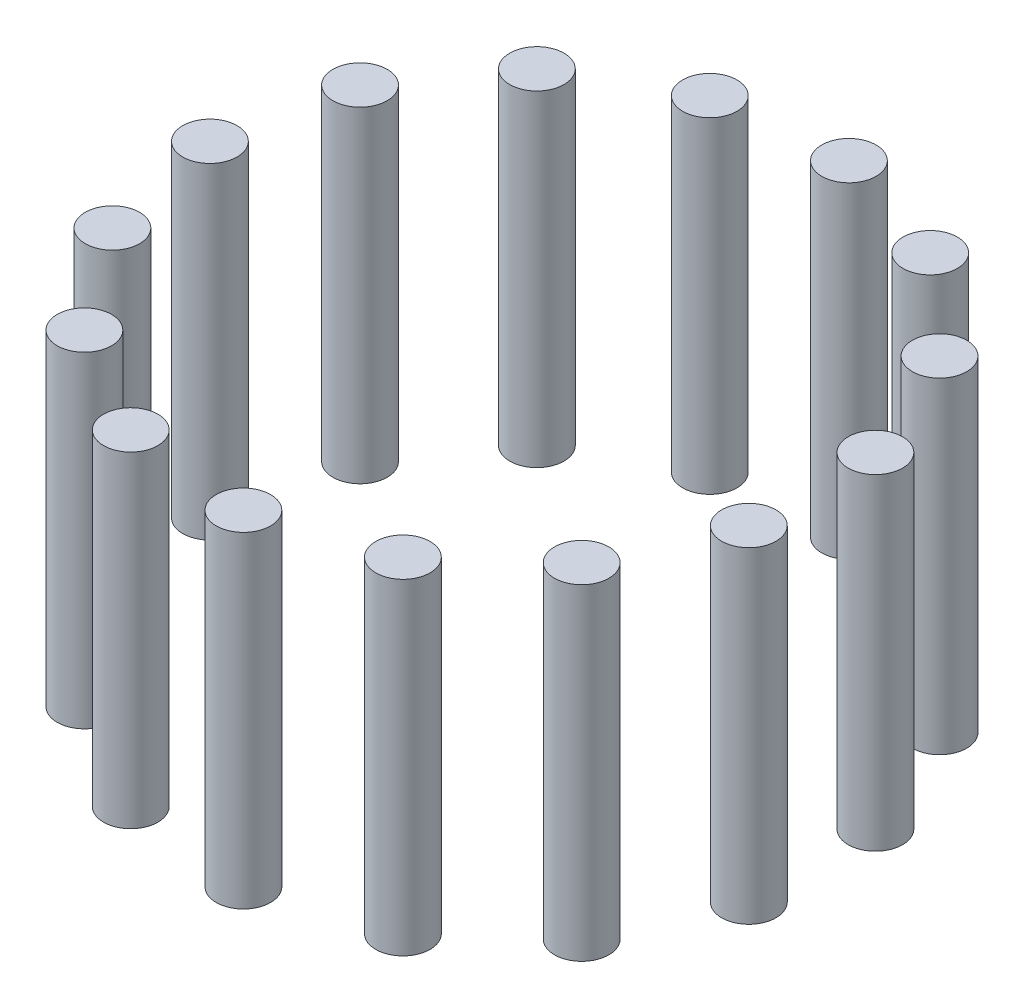
ISO-10303-21;
HEADER;
FILE_DESCRIPTION(('STEP AP214'),'2;1');
FILE_NAME('part.step','',(''),(''),'','','');
FILE_SCHEMA(('AUTOMOTIVE_DESIGN { 1 0 10303 214 1 1 1 1 }'));
ENDSEC;
DATA;
#1=APPLICATION_CONTEXT('core data for automotive mechanical design processes');
#2=APPLICATION_PROTOCOL_DEFINITION('international standard','automotive_design',2000,#1);
#3=PRODUCT_CONTEXT('',#1,'mechanical');
#4=PRODUCT('Part','Part','',(#3));
#5=PRODUCT_RELATED_PRODUCT_CATEGORY('part','',(#4));
#6=PRODUCT_DEFINITION_FORMATION('','',#4);
#7=PRODUCT_DEFINITION_CONTEXT('part definition',#1,'design');
#8=PRODUCT_DEFINITION('design','',#6,#7);
#9=PRODUCT_DEFINITION_SHAPE('','',#8);
#10=(LENGTH_UNIT() NAMED_UNIT(*) SI_UNIT(.MILLI.,.METRE.));
#11=(NAMED_UNIT(*) PLANE_ANGLE_UNIT() SI_UNIT($,.RADIAN.));
#12=(NAMED_UNIT(*) SI_UNIT($,.STERADIAN.) SOLID_ANGLE_UNIT());
#13=UNCERTAINTY_MEASURE_WITH_UNIT(LENGTH_MEASURE(1.E-05),#10,'distance_accuracy_value','');
#14=(GEOMETRIC_REPRESENTATION_CONTEXT(3) GLOBAL_UNCERTAINTY_ASSIGNED_CONTEXT((#13)) GLOBAL_UNIT_ASSIGNED_CONTEXT((#10,
#11,#12)) REPRESENTATION_CONTEXT('',''));
#15=CARTESIAN_POINT('',(0.,0.,0.));
#16=DIRECTION('',(0.,0.,1.));
#17=DIRECTION('',(1.,0.,0.));
#18=AXIS2_PLACEMENT_3D('',#15,#16,#17);
#19=CARTESIAN_POINT('',(22.6524758424982,30.,-16.4579870641889));
#20=DIRECTION('',(0.,-1.,0.));
#21=DIRECTION('',(0.,0.,-1.));
#22=AXIS2_PLACEMENT_3D('',#19,#20,#21);
#23=CYLINDRICAL_SURFACE('',#22,2.50000000000044);
#24=CARTESIAN_POINT('',(22.6524758424982,30.,-16.4579870641889));
#25=DIRECTION('',(0.,1.,0.));
#26=DIRECTION('',(0.,0.,1.));
#27=AXIS2_PLACEMENT_3D('',#24,#25,#26);
#28=CIRCLE('',#27,2.50000000000044);
#29=CARTESIAN_POINT('',(22.6524758424982,30.,-13.9579870641885));
#30=VERTEX_POINT('',#29);
#31=EDGE_CURVE('E11',#30,#30,#28,.T.);
#32=ORIENTED_EDGE('',*,*,#31,.F.);
#33=EDGE_LOOP('',(#32));
#34=FACE_BOUND('',#33,.T.);
#35=CARTESIAN_POINT('',(22.6524758424982,0.,-16.4579870641889));
#36=DIRECTION('',(0.,1.,0.));
#37=DIRECTION('',(0.,0.,1.));
#38=AXIS2_PLACEMENT_3D('',#35,#36,#37);
#39=CIRCLE('',#38,2.50000000000044);
#40=CARTESIAN_POINT('',(22.6524758424982,0.,-13.9579870641885));
#41=VERTEX_POINT('',#40);
#42=EDGE_CURVE('E43',#41,#41,#39,.T.);
#43=ORIENTED_EDGE('',*,*,#42,.T.);
#44=EDGE_LOOP('',(#43));
#45=FACE_BOUND('',#44,.T.);
#46=ADVANCED_FACE('F40',(#34,#45),#23,.T.);
#47=CARTESIAN_POINT('',(22.6524758424982,30.,-16.4579870641889));
#48=DIRECTION('',(0.,1.,0.));
#49=DIRECTION('',(0.,0.,1.));
#50=AXIS2_PLACEMENT_3D('',#47,#48,#49);
#51=PLANE('',#50);
#52=ORIENTED_EDGE('',*,*,#31,.T.);
#53=EDGE_LOOP('',(#52));
#54=FACE_BOUND('',#53,.T.);
#55=ADVANCED_FACE('F55',(#54),#51,.T.);
#56=CARTESIAN_POINT('',(22.6524758424982,0.,-16.4579870641889));
#57=DIRECTION('',(0.,1.,0.));
#58=DIRECTION('',(0.,0.,1.));
#59=AXIS2_PLACEMENT_3D('',#56,#57,#58);
#60=PLANE('',#59);
#61=ORIENTED_EDGE('',*,*,#42,.F.);
#62=EDGE_LOOP('',(#61));
#63=FACE_BOUND('',#62,.T.);
#64=ADVANCED_FACE('F53',(#63),#60,.F.);
#65=CLOSED_SHELL('',(#46,#55,#64));
#66=MANIFOLD_SOLID_BREP('B2',#65);
#67=CARTESIAN_POINT('',(13.9999999999994,30.,-24.2487113059636));
#68=DIRECTION('',(0.,-1.,0.));
#69=DIRECTION('',(0.,0.,-1.));
#70=AXIS2_PLACEMENT_3D('',#67,#68,#69);
#71=CYLINDRICAL_SURFACE('',#70,2.50000000000078);
#72=CARTESIAN_POINT('',(13.9999999999994,30.,-24.2487113059636));
#73=DIRECTION('',(0.,1.,0.));
#74=DIRECTION('',(0.,0.,1.));
#75=AXIS2_PLACEMENT_3D('',#72,#73,#74);
#76=CIRCLE('',#75,2.50000000000078);
#77=CARTESIAN_POINT('',(13.9999999999994,30.,-21.7487113059629));
#78=VERTEX_POINT('',#77);
#79=EDGE_CURVE('E39',#78,#78,#76,.T.);
#80=ORIENTED_EDGE('',*,*,#79,.F.);
#81=EDGE_LOOP('',(#80));
#82=FACE_BOUND('',#81,.T.);
#83=CARTESIAN_POINT('',(13.9999999999994,0.,-24.2487113059636));
#84=DIRECTION('',(0.,1.,0.));
#85=DIRECTION('',(0.,0.,1.));
#86=AXIS2_PLACEMENT_3D('',#83,#84,#85);
#87=CIRCLE('',#86,2.50000000000078);
#88=CARTESIAN_POINT('',(13.9999999999994,0.,-21.7487113059629));
#89=VERTEX_POINT('',#88);
#90=EDGE_CURVE('E92',#89,#89,#87,.T.);
#91=ORIENTED_EDGE('',*,*,#90,.T.);
#92=EDGE_LOOP('',(#91));
#93=FACE_BOUND('',#92,.T.);
#94=ADVANCED_FACE('F89',(#82,#93),#71,.T.);
#95=CARTESIAN_POINT('',(13.9999999999994,30.,-24.2487113059636));
#96=DIRECTION('',(0.,1.,0.));
#97=DIRECTION('',(0.,0.,1.));
#98=AXIS2_PLACEMENT_3D('',#95,#96,#97);
#99=PLANE('',#98);
#100=ORIENTED_EDGE('',*,*,#79,.T.);
#101=EDGE_LOOP('',(#100));
#102=FACE_BOUND('',#101,.T.);
#103=ADVANCED_FACE('F104',(#102),#99,.T.);
#104=CARTESIAN_POINT('',(13.9999999999994,0.,-24.2487113059636));
#105=DIRECTION('',(0.,1.,0.));
#106=DIRECTION('',(0.,0.,1.));
#107=AXIS2_PLACEMENT_3D('',#104,#105,#106);
#108=PLANE('',#107);
#109=ORIENTED_EDGE('',*,*,#90,.F.);
#110=EDGE_LOOP('',(#109));
#111=FACE_BOUND('',#110,.T.);
#112=ADVANCED_FACE('F102',(#111),#108,.F.);
#113=CLOSED_SHELL('',(#94,#103,#112));
#114=MANIFOLD_SOLID_BREP('B6',#113);
#115=CARTESIAN_POINT('',(2.92679697149355,30.,-27.8466130703106));
#116=DIRECTION('',(0.,-1.,0.));
#117=DIRECTION('',(0.,0.,-1.));
#118=AXIS2_PLACEMENT_3D('',#115,#116,#117);
#119=CYLINDRICAL_SURFACE('',#118,2.500000000001);
#120=CARTESIAN_POINT('',(2.92679697149355,30.,-27.8466130703106));
#121=DIRECTION('',(0.,1.,0.));
#122=DIRECTION('',(0.,0.,1.));
#123=AXIS2_PLACEMENT_3D('',#120,#121,#122);
#124=CIRCLE('',#123,2.500000000001);
#125=CARTESIAN_POINT('',(2.92679697149355,30.,-25.3466130703096));
#126=VERTEX_POINT('',#125);
#127=EDGE_CURVE('E88',#126,#126,#124,.T.);
#128=ORIENTED_EDGE('',*,*,#127,.F.);
#129=EDGE_LOOP('',(#128));
#130=FACE_BOUND('',#129,.T.);
#131=CARTESIAN_POINT('',(2.92679697149355,0.,-27.8466130703106));
#132=DIRECTION('',(0.,1.,0.));
#133=DIRECTION('',(0.,0.,1.));
#134=AXIS2_PLACEMENT_3D('',#131,#132,#133);
#135=CIRCLE('',#134,2.500000000001);
#136=CARTESIAN_POINT('',(2.92679697149355,0.,-25.3466130703096));
#137=VERTEX_POINT('',#136);
#138=EDGE_CURVE('E141',#137,#137,#135,.T.);
#139=ORIENTED_EDGE('',*,*,#138,.T.);
#140=EDGE_LOOP('',(#139));
#141=FACE_BOUND('',#140,.T.);
#142=ADVANCED_FACE('F138',(#130,#141),#119,.T.);
#143=CARTESIAN_POINT('',(2.92679697149355,30.,-27.8466130703106));
#144=DIRECTION('',(0.,1.,0.));
#145=DIRECTION('',(0.,0.,1.));
#146=AXIS2_PLACEMENT_3D('',#143,#144,#145);
#147=PLANE('',#146);
#148=ORIENTED_EDGE('',*,*,#127,.T.);
#149=EDGE_LOOP('',(#148));
#150=FACE_BOUND('',#149,.T.);
#151=ADVANCED_FACE('F153',(#150),#147,.T.);
#152=CARTESIAN_POINT('',(2.92679697149355,0.,-27.8466130703106));
#153=DIRECTION('',(0.,1.,0.));
#154=DIRECTION('',(0.,0.,1.));
#155=AXIS2_PLACEMENT_3D('',#152,#153,#154);
#156=PLANE('',#155);
#157=ORIENTED_EDGE('',*,*,#138,.F.);
#158=EDGE_LOOP('',(#157));
#159=FACE_BOUND('',#158,.T.);
#160=ADVANCED_FACE('F151',(#159),#156,.F.);
#161=CLOSED_SHELL('',(#142,#151,#160));
#162=MANIFOLD_SOLID_BREP('B34',#161);
#163=CARTESIAN_POINT('',(-8.65247584249925,30.,-26.6295824562629));
#164=DIRECTION('',(0.,-1.,0.));
#165=DIRECTION('',(0.,0.,-1.));
#166=AXIS2_PLACEMENT_3D('',#163,#164,#165);
#167=CYLINDRICAL_SURFACE('',#166,2.500000000001);
#168=CARTESIAN_POINT('',(-8.65247584249925,30.,-26.6295824562629));
#169=DIRECTION('',(0.,1.,0.));
#170=DIRECTION('',(0.,0.,1.));
#171=AXIS2_PLACEMENT_3D('',#168,#169,#170);
#172=CIRCLE('',#171,2.500000000001);
#173=CARTESIAN_POINT('',(-8.65247584249925,30.,-24.1295824562619));
#174=VERTEX_POINT('',#173);
#175=EDGE_CURVE('E137',#174,#174,#172,.T.);
#176=ORIENTED_EDGE('',*,*,#175,.F.);
#177=EDGE_LOOP('',(#176));
#178=FACE_BOUND('',#177,.T.);
#179=CARTESIAN_POINT('',(-8.65247584249925,0.,-26.6295824562629));
#180=DIRECTION('',(0.,1.,0.));
#181=DIRECTION('',(0.,0.,1.));
#182=AXIS2_PLACEMENT_3D('',#179,#180,#181);
#183=CIRCLE('',#182,2.500000000001);
#184=CARTESIAN_POINT('',(-8.65247584249925,0.,-24.1295824562619));
#185=VERTEX_POINT('',#184);
#186=EDGE_CURVE('E190',#185,#185,#183,.T.);
#187=ORIENTED_EDGE('',*,*,#186,.T.);
#188=EDGE_LOOP('',(#187));
#189=FACE_BOUND('',#188,.T.);
#190=ADVANCED_FACE('F187',(#178,#189),#167,.T.);
#191=CARTESIAN_POINT('',(-8.65247584249925,30.,-26.6295824562629));
#192=DIRECTION('',(0.,1.,0.));
#193=DIRECTION('',(0.,0.,1.));
#194=AXIS2_PLACEMENT_3D('',#191,#192,#193);
#195=PLANE('',#194);
#196=ORIENTED_EDGE('',*,*,#175,.T.);
#197=EDGE_LOOP('',(#196));
#198=FACE_BOUND('',#197,.T.);
#199=ADVANCED_FACE('F202',(#198),#195,.T.);
#200=CARTESIAN_POINT('',(-8.65247584249925,0.,-26.6295824562629));
#201=DIRECTION('',(0.,1.,0.));
#202=DIRECTION('',(0.,0.,1.));
#203=AXIS2_PLACEMENT_3D('',#200,#201,#202);
#204=PLANE('',#203);
#205=ORIENTED_EDGE('',*,*,#186,.F.);
#206=EDGE_LOOP('',(#205));
#207=FACE_BOUND('',#206,.T.);
#208=ADVANCED_FACE('F200',(#207),#204,.F.);
#209=CLOSED_SHELL('',(#190,#199,#208));
#210=MANIFOLD_SOLID_BREP('B83',#209);
#211=CARTESIAN_POINT('',(-18.7356569780485,30.,-20.8080551133652));
#212=DIRECTION('',(0.,-1.,0.));
#213=DIRECTION('',(0.,0.,-1.));
#214=AXIS2_PLACEMENT_3D('',#211,#212,#213);
#215=CYLINDRICAL_SURFACE('',#214,2.50000000000081);
#216=CARTESIAN_POINT('',(-18.7356569780485,30.,-20.8080551133652));
#217=DIRECTION('',(0.,1.,0.));
#218=DIRECTION('',(0.,0.,1.));
#219=AXIS2_PLACEMENT_3D('',#216,#217,#218);
#220=CIRCLE('',#219,2.50000000000081);
#221=CARTESIAN_POINT('',(-18.7356569780485,30.,-18.3080551133644));
#222=VERTEX_POINT('',#221);
#223=EDGE_CURVE('E186',#222,#222,#220,.T.);
#224=ORIENTED_EDGE('',*,*,#223,.F.);
#225=EDGE_LOOP('',(#224));
#226=FACE_BOUND('',#225,.T.);
#227=CARTESIAN_POINT('',(-18.7356569780485,0.,-20.8080551133652));
#228=DIRECTION('',(0.,1.,0.));
#229=DIRECTION('',(0.,0.,1.));
#230=AXIS2_PLACEMENT_3D('',#227,#228,#229);
#231=CIRCLE('',#230,2.50000000000081);
#232=CARTESIAN_POINT('',(-18.7356569780485,0.,-18.3080551133644));
#233=VERTEX_POINT('',#232);
#234=EDGE_CURVE('E239',#233,#233,#231,.T.);
#235=ORIENTED_EDGE('',*,*,#234,.T.);
#236=EDGE_LOOP('',(#235));
#237=FACE_BOUND('',#236,.T.);
#238=ADVANCED_FACE('F236',(#226,#237),#215,.T.);
#239=CARTESIAN_POINT('',(-18.7356569780485,30.,-20.8080551133652));
#240=DIRECTION('',(0.,1.,0.));
#241=DIRECTION('',(0.,0.,1.));
#242=AXIS2_PLACEMENT_3D('',#239,#240,#241);
#243=PLANE('',#242);
#244=ORIENTED_EDGE('',*,*,#223,.T.);
#245=EDGE_LOOP('',(#244));
#246=FACE_BOUND('',#245,.T.);
#247=ADVANCED_FACE('F251',(#246),#243,.T.);
#248=CARTESIAN_POINT('',(-18.7356569780485,0.,-20.8080551133652));
#249=DIRECTION('',(0.,1.,0.));
#250=DIRECTION('',(0.,0.,1.));
#251=AXIS2_PLACEMENT_3D('',#248,#249,#250);
#252=PLANE('',#251);
#253=ORIENTED_EDGE('',*,*,#234,.F.);
#254=EDGE_LOOP('',(#253));
#255=FACE_BOUND('',#254,.T.);
#256=ADVANCED_FACE('F249',(#255),#252,.F.);
#257=CLOSED_SHELL('',(#238,#247,#256));
#258=MANIFOLD_SOLID_BREP('B132',#257);
#259=CARTESIAN_POINT('',(-25.579272813993,30.,-11.3886260061204));
#260=DIRECTION('',(0.,-1.,0.));
#261=DIRECTION('',(0.,0.,-1.));
#262=AXIS2_PLACEMENT_3D('',#259,#260,#261);
#263=CYLINDRICAL_SURFACE('',#262,2.50000000000046);
#264=CARTESIAN_POINT('',(-25.579272813993,30.,-11.3886260061204));
#265=DIRECTION('',(0.,1.,0.));
#266=DIRECTION('',(0.,0.,1.));
#267=AXIS2_PLACEMENT_3D('',#264,#265,#266);
#268=CIRCLE('',#267,2.50000000000046);
#269=CARTESIAN_POINT('',(-25.579272813993,30.,-8.88862600611992));
#270=VERTEX_POINT('',#269);
#271=EDGE_CURVE('E235',#270,#270,#268,.T.);
#272=ORIENTED_EDGE('',*,*,#271,.F.);
#273=EDGE_LOOP('',(#272));
#274=FACE_BOUND('',#273,.T.);
#275=CARTESIAN_POINT('',(-25.579272813993,0.,-11.3886260061204));
#276=DIRECTION('',(0.,1.,0.));
#277=DIRECTION('',(0.,0.,1.));
#278=AXIS2_PLACEMENT_3D('',#275,#276,#277);
#279=CIRCLE('',#278,2.50000000000046);
#280=CARTESIAN_POINT('',(-25.579272813993,0.,-8.88862600611992));
#281=VERTEX_POINT('',#280);
#282=EDGE_CURVE('E288',#281,#281,#279,.T.);
#283=ORIENTED_EDGE('',*,*,#282,.T.);
#284=EDGE_LOOP('',(#283));
#285=FACE_BOUND('',#284,.T.);
#286=ADVANCED_FACE('F285',(#274,#285),#263,.T.);
#287=CARTESIAN_POINT('',(-25.579272813993,30.,-11.3886260061204));
#288=DIRECTION('',(0.,1.,0.));
#289=DIRECTION('',(0.,0.,1.));
#290=AXIS2_PLACEMENT_3D('',#287,#288,#289);
#291=PLANE('',#290);
#292=ORIENTED_EDGE('',*,*,#271,.T.);
#293=EDGE_LOOP('',(#292));
#294=FACE_BOUND('',#293,.T.);
#295=ADVANCED_FACE('F300',(#294),#291,.T.);
#296=CARTESIAN_POINT('',(-25.579272813993,0.,-11.3886260061204));
#297=DIRECTION('',(0.,1.,0.));
#298=DIRECTION('',(0.,0.,1.));
#299=AXIS2_PLACEMENT_3D('',#296,#297,#298);
#300=PLANE('',#299);
#301=ORIENTED_EDGE('',*,*,#282,.F.);
#302=EDGE_LOOP('',(#301));
#303=FACE_BOUND('',#302,.T.);
#304=ADVANCED_FACE('F298',(#303),#300,.F.);
#305=CLOSED_SHELL('',(#286,#295,#304));
#306=MANIFOLD_SOLID_BREP('B181',#305);
#307=CARTESIAN_POINT('',(-27.9999999999998,30.,2.12402832064592E-12));
#308=DIRECTION('',(0.,-1.,0.));
#309=DIRECTION('',(0.,0.,-1.));
#310=AXIS2_PLACEMENT_3D('',#307,#308,#309);
#311=CYLINDRICAL_SURFACE('',#310,2.50000000000001);
#312=CARTESIAN_POINT('',(-27.9999999999998,30.,2.12402832064592E-12));
#313=DIRECTION('',(0.,1.,0.));
#314=DIRECTION('',(0.,0.,1.));
#315=AXIS2_PLACEMENT_3D('',#312,#313,#314);
#316=CIRCLE('',#315,2.50000000000001);
#317=CARTESIAN_POINT('',(-27.9999999999998,30.,2.50000000000214));
#318=VERTEX_POINT('',#317);
#319=EDGE_CURVE('E284',#318,#318,#316,.T.);
#320=ORIENTED_EDGE('',*,*,#319,.F.);
#321=EDGE_LOOP('',(#320));
#322=FACE_BOUND('',#321,.T.);
#323=CARTESIAN_POINT('',(-27.9999999999998,0.,2.12402832064592E-12));
#324=DIRECTION('',(0.,1.,0.));
#325=DIRECTION('',(0.,0.,1.));
#326=AXIS2_PLACEMENT_3D('',#323,#324,#325);
#327=CIRCLE('',#326,2.50000000000001);
#328=CARTESIAN_POINT('',(-27.9999999999998,0.,2.50000000000214));
#329=VERTEX_POINT('',#328);
#330=EDGE_CURVE('E337',#329,#329,#327,.T.);
#331=ORIENTED_EDGE('',*,*,#330,.T.);
#332=EDGE_LOOP('',(#331));
#333=FACE_BOUND('',#332,.T.);
#334=ADVANCED_FACE('F334',(#322,#333),#311,.T.);
#335=CARTESIAN_POINT('',(-27.9999999999998,30.,2.12402832064592E-12));
#336=DIRECTION('',(0.,1.,0.));
#337=DIRECTION('',(0.,0.,1.));
#338=AXIS2_PLACEMENT_3D('',#335,#336,#337);
#339=PLANE('',#338);
#340=ORIENTED_EDGE('',*,*,#319,.T.);
#341=EDGE_LOOP('',(#340));
#342=FACE_BOUND('',#341,.T.);
#343=ADVANCED_FACE('F349',(#342),#339,.T.);
#344=CARTESIAN_POINT('',(-27.9999999999998,0.,2.12402832064592E-12));
#345=DIRECTION('',(0.,1.,0.));
#346=DIRECTION('',(0.,0.,1.));
#347=AXIS2_PLACEMENT_3D('',#344,#345,#346);
#348=PLANE('',#347);
#349=ORIENTED_EDGE('',*,*,#330,.F.);
#350=EDGE_LOOP('',(#349));
#351=FACE_BOUND('',#350,.T.);
#352=ADVANCED_FACE('F347',(#351),#348,.F.);
#353=CLOSED_SHELL('',(#334,#343,#352));
#354=MANIFOLD_SOLID_BREP('B230',#353);
#355=CARTESIAN_POINT('',(-25.5792728139922,30.,11.3886260061244));
#356=DIRECTION('',(0.,-1.,0.));
#357=DIRECTION('',(0.,0.,-1.));
#358=AXIS2_PLACEMENT_3D('',#355,#356,#357);
#359=CYLINDRICAL_SURFACE('',#358,2.49999999999954);
#360=CARTESIAN_POINT('',(-25.5792728139922,30.,11.3886260061244));
#361=DIRECTION('',(0.,1.,0.));
#362=DIRECTION('',(0.,0.,1.));
#363=AXIS2_PLACEMENT_3D('',#360,#361,#362);
#364=CIRCLE('',#363,2.49999999999954);
#365=CARTESIAN_POINT('',(-25.5792728139922,30.,13.888626006124));
#366=VERTEX_POINT('',#365);
#367=EDGE_CURVE('E333',#366,#366,#364,.T.);
#368=ORIENTED_EDGE('',*,*,#367,.F.);
#369=EDGE_LOOP('',(#368));
#370=FACE_BOUND('',#369,.T.);
#371=CARTESIAN_POINT('',(-25.5792728139922,0.,11.3886260061244));
#372=DIRECTION('',(0.,1.,0.));
#373=DIRECTION('',(0.,0.,1.));
#374=AXIS2_PLACEMENT_3D('',#371,#372,#373);
#375=CIRCLE('',#374,2.49999999999954);
#376=CARTESIAN_POINT('',(-25.5792728139922,0.,13.888626006124));
#377=VERTEX_POINT('',#376);
#378=EDGE_CURVE('E386',#377,#377,#375,.T.);
#379=ORIENTED_EDGE('',*,*,#378,.T.);
#380=EDGE_LOOP('',(#379));
#381=FACE_BOUND('',#380,.T.);
#382=ADVANCED_FACE('F383',(#370,#381),#359,.T.);
#383=CARTESIAN_POINT('',(-25.5792728139922,30.,11.3886260061244));
#384=DIRECTION('',(0.,1.,0.));
#385=DIRECTION('',(0.,0.,1.));
#386=AXIS2_PLACEMENT_3D('',#383,#384,#385);
#387=PLANE('',#386);
#388=ORIENTED_EDGE('',*,*,#367,.T.);
#389=EDGE_LOOP('',(#388));
#390=FACE_BOUND('',#389,.T.);
#391=ADVANCED_FACE('F398',(#390),#387,.T.);
#392=CARTESIAN_POINT('',(-25.5792728139922,0.,11.3886260061244));
#393=DIRECTION('',(0.,1.,0.));
#394=DIRECTION('',(0.,0.,1.));
#395=AXIS2_PLACEMENT_3D('',#392,#393,#394);
#396=PLANE('',#395);
#397=ORIENTED_EDGE('',*,*,#378,.F.);
#398=EDGE_LOOP('',(#397));
#399=FACE_BOUND('',#398,.T.);
#400=ADVANCED_FACE('F396',(#399),#396,.F.);
#401=CLOSED_SHELL('',(#382,#391,#400));
#402=MANIFOLD_SOLID_BREP('B279',#401);
#403=CARTESIAN_POINT('',(-18.7356569780471,30.,20.8080551133688));
#404=DIRECTION('',(0.,-1.,0.));
#405=DIRECTION('',(0.,0.,-1.));
#406=AXIS2_PLACEMENT_3D('',#403,#404,#405);
#407=CYLINDRICAL_SURFACE('',#406,2.4999999999991);
#408=CARTESIAN_POINT('',(-18.7356569780471,30.,20.8080551133688));
#409=DIRECTION('',(0.,1.,0.));
#410=DIRECTION('',(0.,0.,1.));
#411=AXIS2_PLACEMENT_3D('',#408,#409,#410);
#412=CIRCLE('',#411,2.4999999999991);
#413=CARTESIAN_POINT('',(-18.7356569780471,30.,23.3080551133679));
#414=VERTEX_POINT('',#413);
#415=EDGE_CURVE('E382',#414,#414,#412,.T.);
#416=ORIENTED_EDGE('',*,*,#415,.F.);
#417=EDGE_LOOP('',(#416));
#418=FACE_BOUND('',#417,.T.);
#419=CARTESIAN_POINT('',(-18.7356569780471,0.,20.8080551133688));
#420=DIRECTION('',(0.,1.,0.));
#421=DIRECTION('',(0.,0.,1.));
#422=AXIS2_PLACEMENT_3D('',#419,#420,#421);
#423=CIRCLE('',#422,2.4999999999991);
#424=CARTESIAN_POINT('',(-18.7356569780471,0.,23.3080551133679));
#425=VERTEX_POINT('',#424);
#426=EDGE_CURVE('E435',#425,#425,#423,.T.);
#427=ORIENTED_EDGE('',*,*,#426,.T.);
#428=EDGE_LOOP('',(#427));
#429=FACE_BOUND('',#428,.T.);
#430=ADVANCED_FACE('F432',(#418,#429),#407,.T.);
#431=CARTESIAN_POINT('',(-18.7356569780471,30.,20.8080551133688));
#432=DIRECTION('',(0.,1.,0.));
#433=DIRECTION('',(0.,0.,1.));
#434=AXIS2_PLACEMENT_3D('',#431,#432,#433);
#435=PLANE('',#434);
#436=ORIENTED_EDGE('',*,*,#415,.T.);
#437=EDGE_LOOP('',(#436));
#438=FACE_BOUND('',#437,.T.);
#439=ADVANCED_FACE('F447',(#438),#435,.T.);
#440=CARTESIAN_POINT('',(-18.7356569780471,0.,20.8080551133688));
#441=DIRECTION('',(0.,1.,0.));
#442=DIRECTION('',(0.,0.,1.));
#443=AXIS2_PLACEMENT_3D('',#440,#441,#442);
#444=PLANE('',#443);
#445=ORIENTED_EDGE('',*,*,#426,.F.);
#446=EDGE_LOOP('',(#445));
#447=FACE_BOUND('',#446,.T.);
#448=ADVANCED_FACE('F445',(#447),#444,.F.);
#449=CLOSED_SHELL('',(#430,#439,#448));
#450=MANIFOLD_SOLID_BREP('B328',#449);
#451=CARTESIAN_POINT('',(-8.65247584249736,30.,26.6295824562658));
#452=DIRECTION('',(0.,-1.,0.));
#453=DIRECTION('',(0.,0.,-1.));
#454=AXIS2_PLACEMENT_3D('',#451,#452,#453);
#455=CYLINDRICAL_SURFACE('',#454,2.49999999999882);
#456=CARTESIAN_POINT('',(-8.65247584249736,30.,26.6295824562658));
#457=DIRECTION('',(0.,1.,0.));
#458=DIRECTION('',(0.,0.,1.));
#459=AXIS2_PLACEMENT_3D('',#456,#457,#458);
#460=CIRCLE('',#459,2.49999999999882);
#461=CARTESIAN_POINT('',(-8.65247584249736,30.,29.1295824562646));
#462=VERTEX_POINT('',#461);
#463=EDGE_CURVE('E431',#462,#462,#460,.T.);
#464=ORIENTED_EDGE('',*,*,#463,.F.);
#465=EDGE_LOOP('',(#464));
#466=FACE_BOUND('',#465,.T.);
#467=CARTESIAN_POINT('',(-8.65247584249736,0.,26.6295824562658));
#468=DIRECTION('',(0.,1.,0.));
#469=DIRECTION('',(0.,0.,1.));
#470=AXIS2_PLACEMENT_3D('',#467,#468,#469);
#471=CIRCLE('',#470,2.49999999999882);
#472=CARTESIAN_POINT('',(-8.65247584249736,0.,29.1295824562646));
#473=VERTEX_POINT('',#472);
#474=EDGE_CURVE('E484',#473,#473,#471,.T.);
#475=ORIENTED_EDGE('',*,*,#474,.T.);
#476=EDGE_LOOP('',(#475));
#477=FACE_BOUND('',#476,.T.);
#478=ADVANCED_FACE('F481',(#466,#477),#455,.T.);
#479=CARTESIAN_POINT('',(-8.65247584249736,30.,26.6295824562658));
#480=DIRECTION('',(0.,1.,0.));
#481=DIRECTION('',(0.,0.,1.));
#482=AXIS2_PLACEMENT_3D('',#479,#480,#481);
#483=PLANE('',#482);
#484=ORIENTED_EDGE('',*,*,#463,.T.);
#485=EDGE_LOOP('',(#484));
#486=FACE_BOUND('',#485,.T.);
#487=ADVANCED_FACE('F496',(#486),#483,.T.);
#488=CARTESIAN_POINT('',(-8.65247584249736,0.,26.6295824562658));
#489=DIRECTION('',(0.,1.,0.));
#490=DIRECTION('',(0.,0.,1.));
#491=AXIS2_PLACEMENT_3D('',#488,#489,#490);
#492=PLANE('',#491);
#493=ORIENTED_EDGE('',*,*,#474,.F.);
#494=EDGE_LOOP('',(#493));
#495=FACE_BOUND('',#494,.T.);
#496=ADVANCED_FACE('F494',(#495),#492,.F.);
#497=CLOSED_SHELL('',(#478,#487,#496));
#498=MANIFOLD_SOLID_BREP('B377',#497);
#499=CARTESIAN_POINT('',(2.9267969714955,30.,27.8466130703127));
#500=DIRECTION('',(0.,-1.,0.));
#501=DIRECTION('',(0.,0.,-1.));
#502=AXIS2_PLACEMENT_3D('',#499,#500,#501);
#503=CYLINDRICAL_SURFACE('',#502,2.49999999999872);
#504=CARTESIAN_POINT('',(2.9267969714955,30.,27.8466130703127));
#505=DIRECTION('',(0.,1.,0.));
#506=DIRECTION('',(0.,0.,1.));
#507=AXIS2_PLACEMENT_3D('',#504,#505,#506);
#508=CIRCLE('',#507,2.49999999999872);
#509=CARTESIAN_POINT('',(2.9267969714955,30.,30.3466130703114));
#510=VERTEX_POINT('',#509);
#511=EDGE_CURVE('E480',#510,#510,#508,.T.);
#512=ORIENTED_EDGE('',*,*,#511,.F.);
#513=EDGE_LOOP('',(#512));
#514=FACE_BOUND('',#513,.T.);
#515=CARTESIAN_POINT('',(2.9267969714955,0.,27.8466130703127));
#516=DIRECTION('',(0.,1.,0.));
#517=DIRECTION('',(0.,0.,1.));
#518=AXIS2_PLACEMENT_3D('',#515,#516,#517);
#519=CIRCLE('',#518,2.49999999999872);
#520=CARTESIAN_POINT('',(2.9267969714955,0.,30.3466130703114));
#521=VERTEX_POINT('',#520);
#522=EDGE_CURVE('E533',#521,#521,#519,.T.);
#523=ORIENTED_EDGE('',*,*,#522,.T.);
#524=EDGE_LOOP('',(#523));
#525=FACE_BOUND('',#524,.T.);
#526=ADVANCED_FACE('F530',(#514,#525),#503,.T.);
#527=CARTESIAN_POINT('',(2.9267969714955,30.,27.8466130703127));
#528=DIRECTION('',(0.,1.,0.));
#529=DIRECTION('',(0.,0.,1.));
#530=AXIS2_PLACEMENT_3D('',#527,#528,#529);
#531=PLANE('',#530);
#532=ORIENTED_EDGE('',*,*,#511,.T.);
#533=EDGE_LOOP('',(#532));
#534=FACE_BOUND('',#533,.T.);
#535=ADVANCED_FACE('F545',(#534),#531,.T.);
#536=CARTESIAN_POINT('',(2.9267969714955,0.,27.8466130703127));
#537=DIRECTION('',(0.,1.,0.));
#538=DIRECTION('',(0.,0.,1.));
#539=AXIS2_PLACEMENT_3D('',#536,#537,#538);
#540=PLANE('',#539);
#541=ORIENTED_EDGE('',*,*,#522,.F.);
#542=EDGE_LOOP('',(#541));
#543=FACE_BOUND('',#542,.T.);
#544=ADVANCED_FACE('F543',(#543),#540,.F.);
#545=CLOSED_SHELL('',(#526,#535,#544));
#546=MANIFOLD_SOLID_BREP('B426',#545);
#547=CARTESIAN_POINT('',(14.0000000000011,30.,24.2487113059649));
#548=DIRECTION('',(0.,-1.,0.));
#549=DIRECTION('',(0.,0.,-1.));
#550=AXIS2_PLACEMENT_3D('',#547,#548,#549);
#551=CYLINDRICAL_SURFACE('',#550,2.49999999999882);
#552=CARTESIAN_POINT('',(14.0000000000011,30.,24.2487113059649));
#553=DIRECTION('',(0.,1.,0.));
#554=DIRECTION('',(0.,0.,1.));
#555=AXIS2_PLACEMENT_3D('',#552,#553,#554);
#556=CIRCLE('',#555,2.49999999999882);
#557=CARTESIAN_POINT('',(14.0000000000011,30.,26.7487113059638));
#558=VERTEX_POINT('',#557);
#559=EDGE_CURVE('E529',#558,#558,#556,.T.);
#560=ORIENTED_EDGE('',*,*,#559,.F.);
#561=EDGE_LOOP('',(#560));
#562=FACE_BOUND('',#561,.T.);
#563=CARTESIAN_POINT('',(14.0000000000011,0.,24.2487113059649));
#564=DIRECTION('',(0.,1.,0.));
#565=DIRECTION('',(0.,0.,1.));
#566=AXIS2_PLACEMENT_3D('',#563,#564,#565);
#567=CIRCLE('',#566,2.49999999999882);
#568=CARTESIAN_POINT('',(14.0000000000011,0.,26.7487113059638));
#569=VERTEX_POINT('',#568);
#570=EDGE_CURVE('E582',#569,#569,#567,.T.);
#571=ORIENTED_EDGE('',*,*,#570,.T.);
#572=EDGE_LOOP('',(#571));
#573=FACE_BOUND('',#572,.T.);
#574=ADVANCED_FACE('F579',(#562,#573),#551,.T.);
#575=CARTESIAN_POINT('',(14.0000000000011,30.,24.2487113059649));
#576=DIRECTION('',(0.,1.,0.));
#577=DIRECTION('',(0.,0.,1.));
#578=AXIS2_PLACEMENT_3D('',#575,#576,#577);
#579=PLANE('',#578);
#580=ORIENTED_EDGE('',*,*,#559,.T.);
#581=EDGE_LOOP('',(#580));
#582=FACE_BOUND('',#581,.T.);
#583=ADVANCED_FACE('F594',(#582),#579,.T.);
#584=CARTESIAN_POINT('',(14.0000000000011,0.,24.2487113059649));
#585=DIRECTION('',(0.,1.,0.));
#586=DIRECTION('',(0.,0.,1.));
#587=AXIS2_PLACEMENT_3D('',#584,#585,#586);
#588=PLANE('',#587);
#589=ORIENTED_EDGE('',*,*,#570,.F.);
#590=EDGE_LOOP('',(#589));
#591=FACE_BOUND('',#590,.T.);
#592=ADVANCED_FACE('F592',(#591),#588,.F.);
#593=CLOSED_SHELL('',(#574,#583,#592));
#594=MANIFOLD_SOLID_BREP('B475',#593);
#595=CARTESIAN_POINT('',(22.6524758424993,30.,16.4579870641896));
#596=DIRECTION('',(0.,-1.,0.));
#597=DIRECTION('',(0.,0.,-1.));
#598=AXIS2_PLACEMENT_3D('',#595,#596,#597);
#599=CYLINDRICAL_SURFACE('',#598,2.49999999999909);
#600=CARTESIAN_POINT('',(22.6524758424993,30.,16.4579870641896));
#601=DIRECTION('',(0.,1.,0.));
#602=DIRECTION('',(0.,0.,1.));
#603=AXIS2_PLACEMENT_3D('',#600,#601,#602);
#604=CIRCLE('',#603,2.49999999999909);
#605=CARTESIAN_POINT('',(22.6524758424993,30.,18.9579870641887));
#606=VERTEX_POINT('',#605);
#607=EDGE_CURVE('E578',#606,#606,#604,.T.);
#608=ORIENTED_EDGE('',*,*,#607,.F.);
#609=EDGE_LOOP('',(#608));
#610=FACE_BOUND('',#609,.T.);
#611=CARTESIAN_POINT('',(22.6524758424993,0.,16.4579870641896));
#612=DIRECTION('',(0.,1.,0.));
#613=DIRECTION('',(0.,0.,1.));
#614=AXIS2_PLACEMENT_3D('',#611,#612,#613);
#615=CIRCLE('',#614,2.49999999999909);
#616=CARTESIAN_POINT('',(22.6524758424993,0.,18.9579870641887));
#617=VERTEX_POINT('',#616);
#618=EDGE_CURVE('E631',#617,#617,#615,.T.);
#619=ORIENTED_EDGE('',*,*,#618,.T.);
#620=EDGE_LOOP('',(#619));
#621=FACE_BOUND('',#620,.T.);
#622=ADVANCED_FACE('F628',(#610,#621),#599,.T.);
#623=CARTESIAN_POINT('',(22.6524758424993,30.,16.4579870641896));
#624=DIRECTION('',(0.,1.,0.));
#625=DIRECTION('',(0.,0.,1.));
#626=AXIS2_PLACEMENT_3D('',#623,#624,#625);
#627=PLANE('',#626);
#628=ORIENTED_EDGE('',*,*,#607,.T.);
#629=EDGE_LOOP('',(#628));
#630=FACE_BOUND('',#629,.T.);
#631=ADVANCED_FACE('F643',(#630),#627,.T.);
#632=CARTESIAN_POINT('',(22.6524758424993,0.,16.4579870641896));
#633=DIRECTION('',(0.,1.,0.));
#634=DIRECTION('',(0.,0.,1.));
#635=AXIS2_PLACEMENT_3D('',#632,#633,#634);
#636=PLANE('',#635);
#637=ORIENTED_EDGE('',*,*,#618,.F.);
#638=EDGE_LOOP('',(#637));
#639=FACE_BOUND('',#638,.T.);
#640=ADVANCED_FACE('F641',(#639),#636,.F.);
#641=CLOSED_SHELL('',(#622,#631,#640));
#642=MANIFOLD_SOLID_BREP('B524',#641);
#643=CARTESIAN_POINT('',(27.3881328205465,30.,5.82152734289747));
#644=DIRECTION('',(0.,-1.,0.));
#645=DIRECTION('',(0.,0.,-1.));
#646=AXIS2_PLACEMENT_3D('',#643,#644,#645);
#647=CYLINDRICAL_SURFACE('',#646,2.5);
#648=CARTESIAN_POINT('',(27.3881328205465,30.,5.82152734289747));
#649=DIRECTION('',(0.,1.,0.));
#650=DIRECTION('',(0.,0.,1.));
#651=AXIS2_PLACEMENT_3D('',#648,#649,#650);
#652=CIRCLE('',#651,2.5);
#653=CARTESIAN_POINT('',(27.3881328205465,30.,8.32152734289747));
#654=VERTEX_POINT('',#653);
#655=EDGE_CURVE('E627',#654,#654,#652,.T.);
#656=ORIENTED_EDGE('',*,*,#655,.F.);
#657=EDGE_LOOP('',(#656));
#658=FACE_BOUND('',#657,.T.);
#659=CARTESIAN_POINT('',(27.3881328205465,0.,5.82152734289747));
#660=DIRECTION('',(0.,1.,0.));
#661=DIRECTION('',(0.,0.,1.));
#662=AXIS2_PLACEMENT_3D('',#659,#660,#661);
#663=CIRCLE('',#662,2.5);
#664=CARTESIAN_POINT('',(27.3881328205465,0.,8.32152734289747));
#665=VERTEX_POINT('',#664);
#666=EDGE_CURVE('E679',#665,#665,#663,.T.);
#667=ORIENTED_EDGE('',*,*,#666,.T.);
#668=EDGE_LOOP('',(#667));
#669=FACE_BOUND('',#668,.T.);
#670=ADVANCED_FACE('F676',(#658,#669),#647,.T.);
#671=CARTESIAN_POINT('',(27.3881328205465,30.,5.82152734289747));
#672=DIRECTION('',(0.,1.,0.));
#673=DIRECTION('',(0.,0.,1.));
#674=AXIS2_PLACEMENT_3D('',#671,#672,#673);
#675=PLANE('',#674);
#676=ORIENTED_EDGE('',*,*,#655,.T.);
#677=EDGE_LOOP('',(#676));
#678=FACE_BOUND('',#677,.T.);
#679=ADVANCED_FACE('F691',(#678),#675,.T.);
#680=CARTESIAN_POINT('',(27.3881328205465,0.,5.82152734289747));
#681=DIRECTION('',(0.,1.,0.));
#682=DIRECTION('',(0.,0.,1.));
#683=AXIS2_PLACEMENT_3D('',#680,#681,#682);
#684=PLANE('',#683);
#685=ORIENTED_EDGE('',*,*,#666,.F.);
#686=EDGE_LOOP('',(#685));
#687=FACE_BOUND('',#686,.T.);
#688=ADVANCED_FACE('F689',(#687),#684,.F.);
#689=CLOSED_SHELL('',(#670,#679,#688));
#690=MANIFOLD_SOLID_BREP('B573',#689);
#691=CARTESIAN_POINT('',(27.3881328205466,30.,-5.82152734289708));
#692=DIRECTION('',(0.,-1.,0.));
#693=DIRECTION('',(0.,0.,-1.));
#694=AXIS2_PLACEMENT_3D('',#691,#692,#693);
#695=CYLINDRICAL_SURFACE('',#694,2.5);
#696=CARTESIAN_POINT('',(27.3881328205466,30.,-5.82152734289708));
#697=DIRECTION('',(0.,1.,0.));
#698=DIRECTION('',(0.,0.,1.));
#699=AXIS2_PLACEMENT_3D('',#696,#697,#698);
#700=CIRCLE('',#699,2.5);
#701=CARTESIAN_POINT('',(27.3881328205466,30.,-3.32152734289708));
#702=VERTEX_POINT('',#701);
#703=EDGE_CURVE('E675',#702,#702,#700,.T.);
#704=ORIENTED_EDGE('',*,*,#703,.F.);
#705=EDGE_LOOP('',(#704));
#706=FACE_BOUND('',#705,.T.);
#707=CARTESIAN_POINT('',(27.3881328205466,0.,-5.82152734289708));
#708=DIRECTION('',(0.,1.,0.));
#709=DIRECTION('',(0.,0.,1.));
#710=AXIS2_PLACEMENT_3D('',#707,#708,#709);
#711=CIRCLE('',#710,2.5);
#712=CARTESIAN_POINT('',(27.3881328205466,0.,-3.32152734289708));
#713=VERTEX_POINT('',#712);
#714=EDGE_CURVE('E720',#713,#713,#711,.T.);
#715=ORIENTED_EDGE('',*,*,#714,.T.);
#716=EDGE_LOOP('',(#715));
#717=FACE_BOUND('',#716,.T.);
#718=ADVANCED_FACE('F717',(#706,#717),#695,.T.);
#719=CARTESIAN_POINT('',(27.3881328205466,30.,-5.82152734289708));
#720=DIRECTION('',(0.,1.,0.));
#721=DIRECTION('',(0.,0.,1.));
#722=AXIS2_PLACEMENT_3D('',#719,#720,#721);
#723=PLANE('',#722);
#724=ORIENTED_EDGE('',*,*,#703,.T.);
#725=EDGE_LOOP('',(#724));
#726=FACE_BOUND('',#725,.T.);
#727=ADVANCED_FACE('F732',(#726),#723,.T.);
#728=CARTESIAN_POINT('',(27.3881328205466,0.,-5.82152734289708));
#729=DIRECTION('',(0.,1.,0.));
#730=DIRECTION('',(0.,0.,1.));
#731=AXIS2_PLACEMENT_3D('',#728,#729,#730);
#732=PLANE('',#731);
#733=ORIENTED_EDGE('',*,*,#714,.F.);
#734=EDGE_LOOP('',(#733));
#735=FACE_BOUND('',#734,.T.);
#736=ADVANCED_FACE('F730',(#735),#732,.F.);
#737=CLOSED_SHELL('',(#718,#727,#736));
#738=MANIFOLD_SOLID_BREP('B622',#737);
#739=ADVANCED_BREP_SHAPE_REPRESENTATION('',(#18,#66,#114,#162,#210,#258,#306,#354,#402,#450,
#498,#546,#594,#642,#690,#738),#14);
#740=SHAPE_DEFINITION_REPRESENTATION(#9,#739);
ENDSEC;
END-ISO-10303-21;
